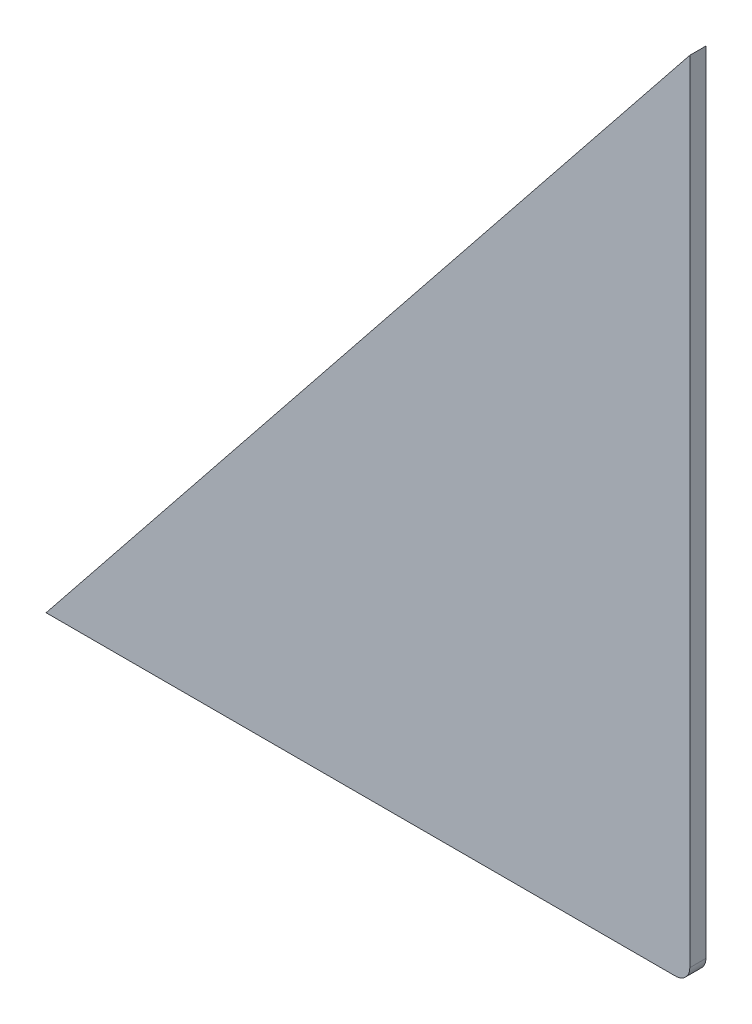
ISO-10303-21;
HEADER;
FILE_DESCRIPTION(('STEP AP214'),'2;1');
FILE_NAME('part.step','',(''),(''),'','','');
FILE_SCHEMA(('AUTOMOTIVE_DESIGN { 1 0 10303 214 1 1 1 1 }'));
ENDSEC;
DATA;
#1=APPLICATION_CONTEXT('core data for automotive mechanical design processes');
#2=APPLICATION_PROTOCOL_DEFINITION('international standard','automotive_design',2000,#1);
#3=PRODUCT_CONTEXT('',#1,'mechanical');
#4=PRODUCT('Part','Part','',(#3));
#5=PRODUCT_RELATED_PRODUCT_CATEGORY('part','',(#4));
#6=PRODUCT_DEFINITION_FORMATION('','',#4);
#7=PRODUCT_DEFINITION_CONTEXT('part definition',#1,'design');
#8=PRODUCT_DEFINITION('design','',#6,#7);
#9=PRODUCT_DEFINITION_SHAPE('','',#8);
#10=(LENGTH_UNIT() NAMED_UNIT(*) SI_UNIT(.MILLI.,.METRE.));
#11=(NAMED_UNIT(*) PLANE_ANGLE_UNIT() SI_UNIT($,.RADIAN.));
#12=(NAMED_UNIT(*) SI_UNIT($,.STERADIAN.) SOLID_ANGLE_UNIT());
#13=UNCERTAINTY_MEASURE_WITH_UNIT(LENGTH_MEASURE(1.E-05),#10,'distance_accuracy_value','');
#14=(GEOMETRIC_REPRESENTATION_CONTEXT(3) GLOBAL_UNCERTAINTY_ASSIGNED_CONTEXT((#13)) GLOBAL_UNIT_ASSIGNED_CONTEXT((#10,
#11,#12)) REPRESENTATION_CONTEXT('',''));
#15=CARTESIAN_POINT('',(0.,0.,0.));
#16=DIRECTION('',(0.,0.,1.));
#17=DIRECTION('',(1.,0.,0.));
#18=AXIS2_PLACEMENT_3D('',#15,#16,#17);
#19=CARTESIAN_POINT('',(0.,100.,1.));
#20=DIRECTION('',(0.78086880944303,-0.624695047554424,0.));
#21=DIRECTION('',(0.624695047554424,0.78086880944303,0.));
#22=AXIS2_PLACEMENT_3D('',#19,#20,#21);
#23=PLANE('',#22);
#24=DIRECTION('',(-0.624695047554424,-0.78086880944303,0.));
#25=VECTOR('',#24,1.);
#26=CARTESIAN_POINT('',(0.,100.,-1.));
#27=LINE('',#26,#25);
#28=CARTESIAN_POINT('',(0.,100.,-1.));
#29=VERTEX_POINT('',#28);
#30=CARTESIAN_POINT('',(-80.,0.,-1.));
#31=VERTEX_POINT('',#30);
#32=EDGE_CURVE('E97',#29,#31,#27,.T.);
#33=ORIENTED_EDGE('',*,*,#32,.T.);
#34=DIRECTION('',(0.,0.,-1.));
#35=VECTOR('',#34,1.);
#36=CARTESIAN_POINT('',(-80.,0.,1.));
#37=LINE('',#36,#35);
#38=CARTESIAN_POINT('',(-80.,0.,1.));
#39=VERTEX_POINT('',#38);
#40=EDGE_CURVE('E11',#39,#31,#37,.T.);
#41=ORIENTED_EDGE('',*,*,#40,.F.);
#42=DIRECTION('',(-0.624695047554424,-0.78086880944303,0.));
#43=VECTOR('',#42,1.);
#44=CARTESIAN_POINT('',(0.,100.,1.));
#45=LINE('',#44,#43);
#46=CARTESIAN_POINT('',(0.,100.,1.));
#47=VERTEX_POINT('',#46);
#48=EDGE_CURVE('E85',#47,#39,#45,.T.);
#49=ORIENTED_EDGE('',*,*,#48,.F.);
#50=DIRECTION('',(0.,0.,-1.));
#51=VECTOR('',#50,1.);
#52=CARTESIAN_POINT('',(0.,100.,1.));
#53=LINE('',#52,#51);
#54=EDGE_CURVE('E93',#47,#29,#53,.T.);
#55=ORIENTED_EDGE('',*,*,#54,.T.);
#56=EDGE_LOOP('',(#33,#41,#49,#55));
#57=FACE_BOUND('',#56,.T.);
#58=ADVANCED_FACE('F34',(#57),#23,.F.);
#59=CARTESIAN_POINT('',(-80.,0.,1.));
#60=DIRECTION('',(0.,1.,0.));
#61=DIRECTION('',(0.,0.,1.));
#62=AXIS2_PLACEMENT_3D('',#59,#60,#61);
#63=PLANE('',#62);
#64=DIRECTION('',(1.,0.,0.));
#65=VECTOR('',#64,1.);
#66=CARTESIAN_POINT('',(-80.,0.,-1.));
#67=LINE('',#66,#65);
#68=CARTESIAN_POINT('',(-1.8,0.,-1.));
#69=VERTEX_POINT('',#68);
#70=EDGE_CURVE('E89',#31,#69,#67,.T.);
#71=ORIENTED_EDGE('',*,*,#70,.T.);
#72=DIRECTION('',(0.,0.,-1.));
#73=VECTOR('',#72,1.);
#74=CARTESIAN_POINT('',(-1.8,0.,1.));
#75=LINE('',#74,#73);
#76=CARTESIAN_POINT('',(-1.8,0.,1.));
#77=VERTEX_POINT('',#76);
#78=EDGE_CURVE('E42',#77,#69,#75,.T.);
#79=ORIENTED_EDGE('',*,*,#78,.F.);
#80=DIRECTION('',(1.,0.,0.));
#81=VECTOR('',#80,1.);
#82=CARTESIAN_POINT('',(-80.,0.,1.));
#83=LINE('',#82,#81);
#84=EDGE_CURVE('E80',#39,#77,#83,.T.);
#85=ORIENTED_EDGE('',*,*,#84,.F.);
#86=ORIENTED_EDGE('',*,*,#40,.T.);
#87=EDGE_LOOP('',(#71,#79,#85,#86));
#88=FACE_BOUND('',#87,.T.);
#89=ADVANCED_FACE('F88',(#88),#63,.F.);
#90=CARTESIAN_POINT('',(-1.8,1.8,1.));
#91=DIRECTION('',(0.,0.,-1.));
#92=DIRECTION('',(-1.,0.,0.));
#93=AXIS2_PLACEMENT_3D('',#90,#91,#92);
#94=CYLINDRICAL_SURFACE('',#93,1.8);
#95=CARTESIAN_POINT('',(-1.8,1.8,-1.));
#96=DIRECTION('',(0.,0.,1.));
#97=DIRECTION('',(1.,0.,0.));
#98=AXIS2_PLACEMENT_3D('',#95,#96,#97);
#99=CIRCLE('',#98,1.8);
#100=CARTESIAN_POINT('',(0.,1.8,-1.));
#101=VERTEX_POINT('',#100);
#102=EDGE_CURVE('E67',#69,#101,#99,.T.);
#103=ORIENTED_EDGE('',*,*,#102,.T.);
#104=DIRECTION('',(0.,0.,-1.));
#105=VECTOR('',#104,1.);
#106=CARTESIAN_POINT('',(0.,1.8,1.));
#107=LINE('',#106,#105);
#108=CARTESIAN_POINT('',(0.,1.8,1.));
#109=VERTEX_POINT('',#108);
#110=EDGE_CURVE('E90',#109,#101,#107,.T.);
#111=ORIENTED_EDGE('',*,*,#110,.F.);
#112=CARTESIAN_POINT('',(-1.8,1.8,1.));
#113=DIRECTION('',(0.,0.,1.));
#114=DIRECTION('',(1.,0.,0.));
#115=AXIS2_PLACEMENT_3D('',#112,#113,#114);
#116=CIRCLE('',#115,1.8);
#117=EDGE_CURVE('E83',#77,#109,#116,.T.);
#118=ORIENTED_EDGE('',*,*,#117,.F.);
#119=ORIENTED_EDGE('',*,*,#78,.T.);
#120=EDGE_LOOP('',(#103,#111,#118,#119));
#121=FACE_BOUND('',#120,.T.);
#122=ADVANCED_FACE('F91',(#121),#94,.T.);
#123=CARTESIAN_POINT('',(0.,1.8,1.));
#124=DIRECTION('',(-1.,0.,0.));
#125=DIRECTION('',(0.,0.,1.));
#126=AXIS2_PLACEMENT_3D('',#123,#124,#125);
#127=PLANE('',#126);
#128=DIRECTION('',(0.,1.,0.));
#129=VECTOR('',#128,1.);
#130=CARTESIAN_POINT('',(0.,1.8,-1.));
#131=LINE('',#130,#129);
#132=EDGE_CURVE('E73',#101,#29,#131,.T.);
#133=ORIENTED_EDGE('',*,*,#132,.T.);
#134=ORIENTED_EDGE('',*,*,#54,.F.);
#135=DIRECTION('',(0.,1.,0.));
#136=VECTOR('',#135,1.);
#137=CARTESIAN_POINT('',(0.,1.8,1.));
#138=LINE('',#137,#136);
#139=EDGE_CURVE('E50',#109,#47,#138,.T.);
#140=ORIENTED_EDGE('',*,*,#139,.F.);
#141=ORIENTED_EDGE('',*,*,#110,.T.);
#142=EDGE_LOOP('',(#133,#134,#140,#141));
#143=FACE_BOUND('',#142,.T.);
#144=ADVANCED_FACE('F104',(#143),#127,.F.);
#145=CARTESIAN_POINT('',(-1.8,1.8,1.));
#146=DIRECTION('',(0.,0.,1.));
#147=DIRECTION('',(1.,0.,0.));
#148=AXIS2_PLACEMENT_3D('',#145,#146,#147);
#149=PLANE('',#148);
#150=ORIENTED_EDGE('',*,*,#48,.T.);
#151=ORIENTED_EDGE('',*,*,#84,.T.);
#152=ORIENTED_EDGE('',*,*,#117,.T.);
#153=ORIENTED_EDGE('',*,*,#139,.T.);
#154=EDGE_LOOP('',(#150,#151,#152,#153));
#155=FACE_BOUND('',#154,.T.);
#156=ADVANCED_FACE('F81',(#155),#149,.T.);
#157=CARTESIAN_POINT('',(-1.8,1.8,-1.));
#158=DIRECTION('',(0.,0.,1.));
#159=DIRECTION('',(1.,0.,0.));
#160=AXIS2_PLACEMENT_3D('',#157,#158,#159);
#161=PLANE('',#160);
#162=ORIENTED_EDGE('',*,*,#32,.F.);
#163=ORIENTED_EDGE('',*,*,#132,.F.);
#164=ORIENTED_EDGE('',*,*,#102,.F.);
#165=ORIENTED_EDGE('',*,*,#70,.F.);
#166=EDGE_LOOP('',(#162,#163,#164,#165));
#167=FACE_BOUND('',#166,.T.);
#168=ADVANCED_FACE('F107',(#167),#161,.F.);
#169=CLOSED_SHELL('',(#58,#89,#122,#144,#156,#168));
#170=MANIFOLD_SOLID_BREP('B2',#169);
#171=ADVANCED_BREP_SHAPE_REPRESENTATION('',(#18,#170),#14);
#172=SHAPE_DEFINITION_REPRESENTATION(#9,#171);
ENDSEC;
END-ISO-10303-21;
